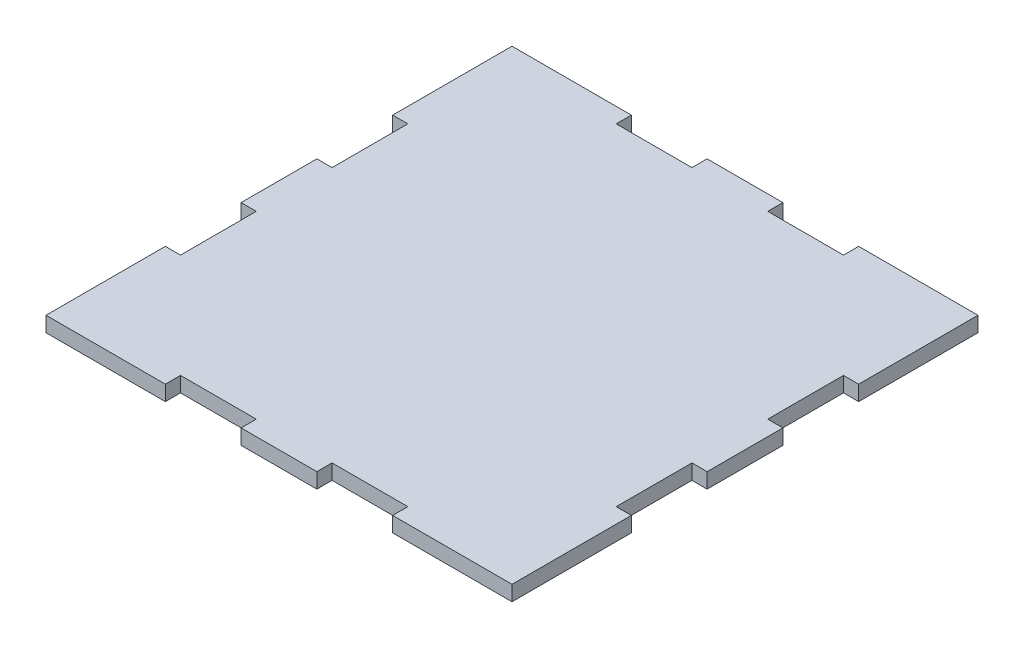
ISO-10303-21;
HEADER;
FILE_DESCRIPTION(('STEP AP214'),'2;1');
FILE_NAME('part.step','',(''),(''),'','','');
FILE_SCHEMA(('AUTOMOTIVE_DESIGN { 1 0 10303 214 1 1 1 1 }'));
ENDSEC;
DATA;
#1=APPLICATION_CONTEXT('core data for automotive mechanical design processes');
#2=APPLICATION_PROTOCOL_DEFINITION('international standard','automotive_design',2000,#1);
#3=PRODUCT_CONTEXT('',#1,'mechanical');
#4=PRODUCT('Part','Part','',(#3));
#5=PRODUCT_RELATED_PRODUCT_CATEGORY('part','',(#4));
#6=PRODUCT_DEFINITION_FORMATION('','',#4);
#7=PRODUCT_DEFINITION_CONTEXT('part definition',#1,'design');
#8=PRODUCT_DEFINITION('design','',#6,#7);
#9=PRODUCT_DEFINITION_SHAPE('','',#8);
#10=(LENGTH_UNIT() NAMED_UNIT(*) SI_UNIT(.MILLI.,.METRE.));
#11=(NAMED_UNIT(*) PLANE_ANGLE_UNIT() SI_UNIT($,.RADIAN.));
#12=(NAMED_UNIT(*) SI_UNIT($,.STERADIAN.) SOLID_ANGLE_UNIT());
#13=UNCERTAINTY_MEASURE_WITH_UNIT(LENGTH_MEASURE(1.E-05),#10,'distance_accuracy_value','');
#14=(GEOMETRIC_REPRESENTATION_CONTEXT(3) GLOBAL_UNCERTAINTY_ASSIGNED_CONTEXT((#13)) GLOBAL_UNIT_ASSIGNED_CONTEXT((#10,
#11,#12)) REPRESENTATION_CONTEXT('',''));
#15=CARTESIAN_POINT('',(0.,0.,0.));
#16=DIRECTION('',(0.,0.,1.));
#17=DIRECTION('',(1.,0.,0.));
#18=AXIS2_PLACEMENT_3D('',#15,#16,#17);
#19=CARTESIAN_POINT('',(0.,4.,0.));
#20=DIRECTION('',(1.,0.,0.));
#21=DIRECTION('',(0.,0.,-1.));
#22=AXIS2_PLACEMENT_3D('',#19,#20,#21);
#23=PLANE('',#22);
#24=DIRECTION('',(0.,0.,1.));
#25=VECTOR('',#24,1.);
#26=CARTESIAN_POINT('',(0.,0.,0.));
#27=LINE('',#26,#25);
#28=CARTESIAN_POINT('',(0.,0.,-31.5));
#29=VERTEX_POINT('',#28);
#30=CARTESIAN_POINT('',(0.,0.,0.));
#31=VERTEX_POINT('',#30);
#32=EDGE_CURVE('E308',#29,#31,#27,.T.);
#33=ORIENTED_EDGE('',*,*,#32,.T.);
#34=DIRECTION('',(0.,-1.,0.));
#35=VECTOR('',#34,1.);
#36=CARTESIAN_POINT('',(0.,4.,0.));
#37=LINE('',#36,#35);
#38=CARTESIAN_POINT('',(0.,4.,0.));
#39=VERTEX_POINT('',#38);
#40=EDGE_CURVE('E11',#39,#31,#37,.T.);
#41=ORIENTED_EDGE('',*,*,#40,.F.);
#42=DIRECTION('',(0.,0.,1.));
#43=VECTOR('',#42,1.);
#44=CARTESIAN_POINT('',(0.,4.,0.));
#45=LINE('',#44,#43);
#46=CARTESIAN_POINT('',(0.,4.,-31.5));
#47=VERTEX_POINT('',#46);
#48=EDGE_CURVE('E414',#47,#39,#45,.T.);
#49=ORIENTED_EDGE('',*,*,#48,.F.);
#50=DIRECTION('',(0.,-1.,0.));
#51=VECTOR('',#50,1.);
#52=CARTESIAN_POINT('',(0.,4.,-31.5));
#53=LINE('',#52,#51);
#54=EDGE_CURVE('E304',#47,#29,#53,.T.);
#55=ORIENTED_EDGE('',*,*,#54,.T.);
#56=EDGE_LOOP('',(#33,#41,#49,#55));
#57=FACE_BOUND('',#56,.T.);
#58=ADVANCED_FACE('F39',(#57),#23,.F.);
#59=CARTESIAN_POINT('',(0.,4.,0.));
#60=DIRECTION('',(0.,0.,-1.));
#61=DIRECTION('',(-1.,0.,0.));
#62=AXIS2_PLACEMENT_3D('',#59,#60,#61);
#63=PLANE('',#62);
#64=DIRECTION('',(1.,0.,0.));
#65=VECTOR('',#64,1.);
#66=CARTESIAN_POINT('',(0.,0.,0.));
#67=LINE('',#66,#65);
#68=CARTESIAN_POINT('',(31.5,0.,0.));
#69=VERTEX_POINT('',#68);
#70=EDGE_CURVE('E312',#31,#69,#67,.T.);
#71=ORIENTED_EDGE('',*,*,#70,.T.);
#72=DIRECTION('',(0.,-1.,0.));
#73=VECTOR('',#72,1.);
#74=CARTESIAN_POINT('',(31.5,4.,0.));
#75=LINE('',#74,#73);
#76=CARTESIAN_POINT('',(31.5,4.,0.));
#77=VERTEX_POINT('',#76);
#78=EDGE_CURVE('E48',#77,#69,#75,.T.);
#79=ORIENTED_EDGE('',*,*,#78,.F.);
#80=DIRECTION('',(1.,0.,0.));
#81=VECTOR('',#80,1.);
#82=CARTESIAN_POINT('',(0.,4.,0.));
#83=LINE('',#82,#81);
#84=EDGE_CURVE('E183',#39,#77,#83,.T.);
#85=ORIENTED_EDGE('',*,*,#84,.F.);
#86=ORIENTED_EDGE('',*,*,#40,.T.);
#87=EDGE_LOOP('',(#71,#79,#85,#86));
#88=FACE_BOUND('',#87,.T.);
#89=ADVANCED_FACE('F676',(#88),#63,.F.);
#90=CARTESIAN_POINT('',(31.5,4.,0.));
#91=DIRECTION('',(-1.,0.,0.));
#92=DIRECTION('',(0.,0.,1.));
#93=AXIS2_PLACEMENT_3D('',#90,#91,#92);
#94=PLANE('',#93);
#95=DIRECTION('',(0.,0.,-1.));
#96=VECTOR('',#95,1.);
#97=CARTESIAN_POINT('',(31.5,0.,0.));
#98=LINE('',#97,#96);
#99=CARTESIAN_POINT('',(31.5,0.,-4.));
#100=VERTEX_POINT('',#99);
#101=EDGE_CURVE('E315',#69,#100,#98,.T.);
#102=ORIENTED_EDGE('',*,*,#101,.T.);
#103=DIRECTION('',(0.,-1.,0.));
#104=VECTOR('',#103,1.);
#105=CARTESIAN_POINT('',(31.5,4.,-4.));
#106=LINE('',#105,#104);
#107=CARTESIAN_POINT('',(31.5,4.,-4.));
#108=VERTEX_POINT('',#107);
#109=EDGE_CURVE('E537',#108,#100,#106,.T.);
#110=ORIENTED_EDGE('',*,*,#109,.F.);
#111=DIRECTION('',(0.,0.,-1.));
#112=VECTOR('',#111,1.);
#113=CARTESIAN_POINT('',(31.5,4.,0.));
#114=LINE('',#113,#112);
#115=EDGE_CURVE('E547',#77,#108,#114,.T.);
#116=ORIENTED_EDGE('',*,*,#115,.F.);
#117=ORIENTED_EDGE('',*,*,#78,.T.);
#118=EDGE_LOOP('',(#102,#110,#116,#117));
#119=FACE_BOUND('',#118,.T.);
#120=ADVANCED_FACE('F545',(#119),#94,.F.);
#121=CARTESIAN_POINT('',(31.5,4.,-4.));
#122=DIRECTION('',(0.,0.,-1.));
#123=DIRECTION('',(-1.,0.,0.));
#124=AXIS2_PLACEMENT_3D('',#121,#122,#123);
#125=PLANE('',#124);
#126=DIRECTION('',(1.,0.,0.));
#127=VECTOR('',#126,1.);
#128=CARTESIAN_POINT('',(31.5,0.,-4.));
#129=LINE('',#128,#127);
#130=CARTESIAN_POINT('',(51.5,0.,-4.));
#131=VERTEX_POINT('',#130);
#132=EDGE_CURVE('E318',#100,#131,#129,.T.);
#133=ORIENTED_EDGE('',*,*,#132,.T.);
#134=DIRECTION('',(0.,-1.,0.));
#135=VECTOR('',#134,1.);
#136=CARTESIAN_POINT('',(51.5,4.,-4.));
#137=LINE('',#136,#135);
#138=CARTESIAN_POINT('',(51.5,4.,-4.));
#139=VERTEX_POINT('',#138);
#140=EDGE_CURVE('E533',#139,#131,#137,.T.);
#141=ORIENTED_EDGE('',*,*,#140,.F.);
#142=DIRECTION('',(1.,0.,0.));
#143=VECTOR('',#142,1.);
#144=CARTESIAN_POINT('',(31.5,4.,-4.));
#145=LINE('',#144,#143);
#146=EDGE_CURVE('E566',#108,#139,#145,.T.);
#147=ORIENTED_EDGE('',*,*,#146,.F.);
#148=ORIENTED_EDGE('',*,*,#109,.T.);
#149=EDGE_LOOP('',(#133,#141,#147,#148));
#150=FACE_BOUND('',#149,.T.);
#151=ADVANCED_FACE('F556',(#150),#125,.F.);
#152=CARTESIAN_POINT('',(51.5,4.,-4.));
#153=DIRECTION('',(1.,0.,0.));
#154=DIRECTION('',(0.,0.,-1.));
#155=AXIS2_PLACEMENT_3D('',#152,#153,#154);
#156=PLANE('',#155);
#157=DIRECTION('',(0.,0.,1.));
#158=VECTOR('',#157,1.);
#159=CARTESIAN_POINT('',(51.5,0.,-4.));
#160=LINE('',#159,#158);
#161=CARTESIAN_POINT('',(51.5,0.,0.));
#162=VERTEX_POINT('',#161);
#163=EDGE_CURVE('E321',#131,#162,#160,.T.);
#164=ORIENTED_EDGE('',*,*,#163,.T.);
#165=DIRECTION('',(0.,-1.,0.));
#166=VECTOR('',#165,1.);
#167=CARTESIAN_POINT('',(51.5,4.,0.));
#168=LINE('',#167,#166);
#169=CARTESIAN_POINT('',(51.5,4.,0.));
#170=VERTEX_POINT('',#169);
#171=EDGE_CURVE('E529',#170,#162,#168,.T.);
#172=ORIENTED_EDGE('',*,*,#171,.F.);
#173=DIRECTION('',(0.,0.,1.));
#174=VECTOR('',#173,1.);
#175=CARTESIAN_POINT('',(51.5,4.,-4.));
#176=LINE('',#175,#174);
#177=EDGE_CURVE('E562',#139,#170,#176,.T.);
#178=ORIENTED_EDGE('',*,*,#177,.F.);
#179=ORIENTED_EDGE('',*,*,#140,.T.);
#180=EDGE_LOOP('',(#164,#172,#178,#179));
#181=FACE_BOUND('',#180,.T.);
#182=ADVANCED_FACE('F560',(#181),#156,.F.);
#183=CARTESIAN_POINT('',(51.5,4.,0.));
#184=DIRECTION('',(0.,0.,-1.));
#185=DIRECTION('',(-1.,0.,0.));
#186=AXIS2_PLACEMENT_3D('',#183,#184,#185);
#187=PLANE('',#186);
#188=DIRECTION('',(1.,0.,0.));
#189=VECTOR('',#188,1.);
#190=CARTESIAN_POINT('',(51.5,0.,0.));
#191=LINE('',#190,#189);
#192=CARTESIAN_POINT('',(71.5,0.,0.));
#193=VERTEX_POINT('',#192);
#194=EDGE_CURVE('E324',#162,#193,#191,.T.);
#195=ORIENTED_EDGE('',*,*,#194,.T.);
#196=DIRECTION('',(0.,-1.,0.));
#197=VECTOR('',#196,1.);
#198=CARTESIAN_POINT('',(71.5,4.,0.));
#199=LINE('',#198,#197);
#200=CARTESIAN_POINT('',(71.5,4.,0.));
#201=VERTEX_POINT('',#200);
#202=EDGE_CURVE('E525',#201,#193,#199,.T.);
#203=ORIENTED_EDGE('',*,*,#202,.F.);
#204=DIRECTION('',(1.,0.,0.));
#205=VECTOR('',#204,1.);
#206=CARTESIAN_POINT('',(51.5,4.,0.));
#207=LINE('',#206,#205);
#208=EDGE_CURVE('E565',#170,#201,#207,.T.);
#209=ORIENTED_EDGE('',*,*,#208,.F.);
#210=ORIENTED_EDGE('',*,*,#171,.T.);
#211=EDGE_LOOP('',(#195,#203,#209,#210));
#212=FACE_BOUND('',#211,.T.);
#213=ADVANCED_FACE('F689',(#212),#187,.F.);
#214=CARTESIAN_POINT('',(71.5,4.,0.));
#215=DIRECTION('',(-1.,0.,0.));
#216=DIRECTION('',(0.,0.,1.));
#217=AXIS2_PLACEMENT_3D('',#214,#215,#216);
#218=PLANE('',#217);
#219=DIRECTION('',(0.,0.,-1.));
#220=VECTOR('',#219,1.);
#221=CARTESIAN_POINT('',(71.5,0.,0.));
#222=LINE('',#221,#220);
#223=CARTESIAN_POINT('',(71.5,0.,-4.));
#224=VERTEX_POINT('',#223);
#225=EDGE_CURVE('E327',#193,#224,#222,.T.);
#226=ORIENTED_EDGE('',*,*,#225,.T.);
#227=DIRECTION('',(0.,-1.,0.));
#228=VECTOR('',#227,1.);
#229=CARTESIAN_POINT('',(71.5,4.,-4.));
#230=LINE('',#229,#228);
#231=CARTESIAN_POINT('',(71.5,4.,-4.));
#232=VERTEX_POINT('',#231);
#233=EDGE_CURVE('E521',#232,#224,#230,.T.);
#234=ORIENTED_EDGE('',*,*,#233,.F.);
#235=DIRECTION('',(0.,0.,-1.));
#236=VECTOR('',#235,1.);
#237=CARTESIAN_POINT('',(71.5,4.,0.));
#238=LINE('',#237,#236);
#239=EDGE_CURVE('E570',#201,#232,#238,.T.);
#240=ORIENTED_EDGE('',*,*,#239,.F.);
#241=ORIENTED_EDGE('',*,*,#202,.T.);
#242=EDGE_LOOP('',(#226,#234,#240,#241));
#243=FACE_BOUND('',#242,.T.);
#244=ADVANCED_FACE('F692',(#243),#218,.F.);
#245=CARTESIAN_POINT('',(71.5,4.,-4.));
#246=DIRECTION('',(0.,0.,-1.));
#247=DIRECTION('',(-1.,0.,0.));
#248=AXIS2_PLACEMENT_3D('',#245,#246,#247);
#249=PLANE('',#248);
#250=DIRECTION('',(1.,0.,0.));
#251=VECTOR('',#250,1.);
#252=CARTESIAN_POINT('',(71.5,0.,-4.));
#253=LINE('',#252,#251);
#254=CARTESIAN_POINT('',(91.5,0.,-4.));
#255=VERTEX_POINT('',#254);
#256=EDGE_CURVE('E330',#224,#255,#253,.T.);
#257=ORIENTED_EDGE('',*,*,#256,.T.);
#258=DIRECTION('',(0.,-1.,0.));
#259=VECTOR('',#258,1.);
#260=CARTESIAN_POINT('',(91.5,4.,-4.));
#261=LINE('',#260,#259);
#262=CARTESIAN_POINT('',(91.5,4.,-4.));
#263=VERTEX_POINT('',#262);
#264=EDGE_CURVE('E517',#263,#255,#261,.T.);
#265=ORIENTED_EDGE('',*,*,#264,.F.);
#266=DIRECTION('',(1.,0.,0.));
#267=VECTOR('',#266,1.);
#268=CARTESIAN_POINT('',(71.5,4.,-4.));
#269=LINE('',#268,#267);
#270=EDGE_CURVE('E577',#232,#263,#269,.T.);
#271=ORIENTED_EDGE('',*,*,#270,.F.);
#272=ORIENTED_EDGE('',*,*,#233,.T.);
#273=EDGE_LOOP('',(#257,#265,#271,#272));
#274=FACE_BOUND('',#273,.T.);
#275=ADVANCED_FACE('F696',(#274),#249,.F.);
#276=CARTESIAN_POINT('',(91.5,4.,-4.));
#277=DIRECTION('',(1.,0.,0.));
#278=DIRECTION('',(0.,0.,-1.));
#279=AXIS2_PLACEMENT_3D('',#276,#277,#278);
#280=PLANE('',#279);
#281=DIRECTION('',(0.,0.,1.));
#282=VECTOR('',#281,1.);
#283=CARTESIAN_POINT('',(91.5,0.,-4.));
#284=LINE('',#283,#282);
#285=CARTESIAN_POINT('',(91.5,0.,0.));
#286=VERTEX_POINT('',#285);
#287=EDGE_CURVE('E333',#255,#286,#284,.T.);
#288=ORIENTED_EDGE('',*,*,#287,.T.);
#289=DIRECTION('',(0.,-1.,0.));
#290=VECTOR('',#289,1.);
#291=CARTESIAN_POINT('',(91.5,4.,0.));
#292=LINE('',#291,#290);
#293=CARTESIAN_POINT('',(91.5,4.,0.));
#294=VERTEX_POINT('',#293);
#295=EDGE_CURVE('E513',#294,#286,#292,.T.);
#296=ORIENTED_EDGE('',*,*,#295,.F.);
#297=DIRECTION('',(0.,0.,1.));
#298=VECTOR('',#297,1.);
#299=CARTESIAN_POINT('',(91.5,4.,-4.));
#300=LINE('',#299,#298);
#301=EDGE_CURVE('E580',#263,#294,#300,.T.);
#302=ORIENTED_EDGE('',*,*,#301,.F.);
#303=ORIENTED_EDGE('',*,*,#264,.T.);
#304=EDGE_LOOP('',(#288,#296,#302,#303));
#305=FACE_BOUND('',#304,.T.);
#306=ADVANCED_FACE('F700',(#305),#280,.F.);
#307=CARTESIAN_POINT('',(91.5,4.,0.));
#308=DIRECTION('',(0.,0.,-1.));
#309=DIRECTION('',(-1.,0.,0.));
#310=AXIS2_PLACEMENT_3D('',#307,#308,#309);
#311=PLANE('',#310);
#312=DIRECTION('',(1.,0.,0.));
#313=VECTOR('',#312,1.);
#314=CARTESIAN_POINT('',(91.5,0.,0.));
#315=LINE('',#314,#313);
#316=CARTESIAN_POINT('',(123.,0.,0.));
#317=VERTEX_POINT('',#316);
#318=EDGE_CURVE('E336',#286,#317,#315,.T.);
#319=ORIENTED_EDGE('',*,*,#318,.T.);
#320=DIRECTION('',(0.,-1.,0.));
#321=VECTOR('',#320,1.);
#322=CARTESIAN_POINT('',(123.,4.,0.));
#323=LINE('',#322,#321);
#324=CARTESIAN_POINT('',(123.,4.,0.));
#325=VERTEX_POINT('',#324);
#326=EDGE_CURVE('E509',#325,#317,#323,.T.);
#327=ORIENTED_EDGE('',*,*,#326,.F.);
#328=DIRECTION('',(1.,0.,0.));
#329=VECTOR('',#328,1.);
#330=CARTESIAN_POINT('',(91.5,4.,0.));
#331=LINE('',#330,#329);
#332=EDGE_CURVE('E583',#294,#325,#331,.T.);
#333=ORIENTED_EDGE('',*,*,#332,.F.);
#334=ORIENTED_EDGE('',*,*,#295,.T.);
#335=EDGE_LOOP('',(#319,#327,#333,#334));
#336=FACE_BOUND('',#335,.T.);
#337=ADVANCED_FACE('F704',(#336),#311,.F.);
#338=CARTESIAN_POINT('',(123.,4.,0.));
#339=DIRECTION('',(-1.,0.,0.));
#340=DIRECTION('',(0.,0.,1.));
#341=AXIS2_PLACEMENT_3D('',#338,#339,#340);
#342=PLANE('',#341);
#343=DIRECTION('',(0.,0.,-1.));
#344=VECTOR('',#343,1.);
#345=CARTESIAN_POINT('',(123.,0.,0.));
#346=LINE('',#345,#344);
#347=CARTESIAN_POINT('',(123.,0.,-31.5));
#348=VERTEX_POINT('',#347);
#349=EDGE_CURVE('E339',#317,#348,#346,.T.);
#350=ORIENTED_EDGE('',*,*,#349,.T.);
#351=DIRECTION('',(0.,-1.,0.));
#352=VECTOR('',#351,1.);
#353=CARTESIAN_POINT('',(123.,4.,-31.5));
#354=LINE('',#353,#352);
#355=CARTESIAN_POINT('',(123.,4.,-31.5));
#356=VERTEX_POINT('',#355);
#357=EDGE_CURVE('E505',#356,#348,#354,.T.);
#358=ORIENTED_EDGE('',*,*,#357,.F.);
#359=DIRECTION('',(0.,0.,-1.));
#360=VECTOR('',#359,1.);
#361=CARTESIAN_POINT('',(123.,4.,0.));
#362=LINE('',#361,#360);
#363=EDGE_CURVE('E586',#325,#356,#362,.T.);
#364=ORIENTED_EDGE('',*,*,#363,.F.);
#365=ORIENTED_EDGE('',*,*,#326,.T.);
#366=EDGE_LOOP('',(#350,#358,#364,#365));
#367=FACE_BOUND('',#366,.T.);
#368=ADVANCED_FACE('F708',(#367),#342,.F.);
#369=CARTESIAN_POINT('',(123.,4.,-31.5));
#370=DIRECTION('',(0.,0.,1.));
#371=DIRECTION('',(1.,0.,0.));
#372=AXIS2_PLACEMENT_3D('',#369,#370,#371);
#373=PLANE('',#372);
#374=DIRECTION('',(-1.,0.,0.));
#375=VECTOR('',#374,1.);
#376=CARTESIAN_POINT('',(123.,0.,-31.5));
#377=LINE('',#376,#375);
#378=CARTESIAN_POINT('',(119.,0.,-31.5));
#379=VERTEX_POINT('',#378);
#380=EDGE_CURVE('E342',#348,#379,#377,.T.);
#381=ORIENTED_EDGE('',*,*,#380,.T.);
#382=DIRECTION('',(0.,-1.,0.));
#383=VECTOR('',#382,1.);
#384=CARTESIAN_POINT('',(119.,4.,-31.5));
#385=LINE('',#384,#383);
#386=CARTESIAN_POINT('',(119.,4.,-31.5));
#387=VERTEX_POINT('',#386);
#388=EDGE_CURVE('E501',#387,#379,#385,.T.);
#389=ORIENTED_EDGE('',*,*,#388,.F.);
#390=DIRECTION('',(-1.,0.,0.));
#391=VECTOR('',#390,1.);
#392=CARTESIAN_POINT('',(123.,4.,-31.5));
#393=LINE('',#392,#391);
#394=EDGE_CURVE('E589',#356,#387,#393,.T.);
#395=ORIENTED_EDGE('',*,*,#394,.F.);
#396=ORIENTED_EDGE('',*,*,#357,.T.);
#397=EDGE_LOOP('',(#381,#389,#395,#396));
#398=FACE_BOUND('',#397,.T.);
#399=ADVANCED_FACE('F712',(#398),#373,.F.);
#400=CARTESIAN_POINT('',(119.,4.,-31.5));
#401=DIRECTION('',(-1.,0.,0.));
#402=DIRECTION('',(0.,0.,1.));
#403=AXIS2_PLACEMENT_3D('',#400,#401,#402);
#404=PLANE('',#403);
#405=DIRECTION('',(0.,0.,-1.));
#406=VECTOR('',#405,1.);
#407=CARTESIAN_POINT('',(119.,0.,-31.5));
#408=LINE('',#407,#406);
#409=CARTESIAN_POINT('',(119.,0.,-51.5));
#410=VERTEX_POINT('',#409);
#411=EDGE_CURVE('E345',#379,#410,#408,.T.);
#412=ORIENTED_EDGE('',*,*,#411,.T.);
#413=DIRECTION('',(0.,-1.,0.));
#414=VECTOR('',#413,1.);
#415=CARTESIAN_POINT('',(119.,4.,-51.5));
#416=LINE('',#415,#414);
#417=CARTESIAN_POINT('',(119.,4.,-51.5));
#418=VERTEX_POINT('',#417);
#419=EDGE_CURVE('E497',#418,#410,#416,.T.);
#420=ORIENTED_EDGE('',*,*,#419,.F.);
#421=DIRECTION('',(0.,0.,-1.));
#422=VECTOR('',#421,1.);
#423=CARTESIAN_POINT('',(119.,4.,-31.5));
#424=LINE('',#423,#422);
#425=EDGE_CURVE('E592',#387,#418,#424,.T.);
#426=ORIENTED_EDGE('',*,*,#425,.F.);
#427=ORIENTED_EDGE('',*,*,#388,.T.);
#428=EDGE_LOOP('',(#412,#420,#426,#427));
#429=FACE_BOUND('',#428,.T.);
#430=ADVANCED_FACE('F716',(#429),#404,.F.);
#431=CARTESIAN_POINT('',(119.,4.,-51.5));
#432=DIRECTION('',(0.,0.,-1.));
#433=DIRECTION('',(-1.,0.,0.));
#434=AXIS2_PLACEMENT_3D('',#431,#432,#433);
#435=PLANE('',#434);
#436=DIRECTION('',(1.,0.,0.));
#437=VECTOR('',#436,1.);
#438=CARTESIAN_POINT('',(119.,0.,-51.5));
#439=LINE('',#438,#437);
#440=CARTESIAN_POINT('',(123.,0.,-51.5));
#441=VERTEX_POINT('',#440);
#442=EDGE_CURVE('E348',#410,#441,#439,.T.);
#443=ORIENTED_EDGE('',*,*,#442,.T.);
#444=DIRECTION('',(0.,-1.,0.));
#445=VECTOR('',#444,1.);
#446=CARTESIAN_POINT('',(123.,4.,-51.5));
#447=LINE('',#446,#445);
#448=CARTESIAN_POINT('',(123.,4.,-51.5));
#449=VERTEX_POINT('',#448);
#450=EDGE_CURVE('E493',#449,#441,#447,.T.);
#451=ORIENTED_EDGE('',*,*,#450,.F.);
#452=DIRECTION('',(1.,0.,0.));
#453=VECTOR('',#452,1.);
#454=CARTESIAN_POINT('',(119.,4.,-51.5));
#455=LINE('',#454,#453);
#456=EDGE_CURVE('E595',#418,#449,#455,.T.);
#457=ORIENTED_EDGE('',*,*,#456,.F.);
#458=ORIENTED_EDGE('',*,*,#419,.T.);
#459=EDGE_LOOP('',(#443,#451,#457,#458));
#460=FACE_BOUND('',#459,.T.);
#461=ADVANCED_FACE('F720',(#460),#435,.F.);
#462=CARTESIAN_POINT('',(123.,4.,-51.5));
#463=DIRECTION('',(-1.,0.,0.));
#464=DIRECTION('',(0.,0.,1.));
#465=AXIS2_PLACEMENT_3D('',#462,#463,#464);
#466=PLANE('',#465);
#467=DIRECTION('',(0.,0.,-1.));
#468=VECTOR('',#467,1.);
#469=CARTESIAN_POINT('',(123.,0.,-51.5));
#470=LINE('',#469,#468);
#471=CARTESIAN_POINT('',(123.,0.,-71.5));
#472=VERTEX_POINT('',#471);
#473=EDGE_CURVE('E351',#441,#472,#470,.T.);
#474=ORIENTED_EDGE('',*,*,#473,.T.);
#475=DIRECTION('',(0.,-1.,0.));
#476=VECTOR('',#475,1.);
#477=CARTESIAN_POINT('',(123.,4.,-71.5));
#478=LINE('',#477,#476);
#479=CARTESIAN_POINT('',(123.,4.,-71.5));
#480=VERTEX_POINT('',#479);
#481=EDGE_CURVE('E489',#480,#472,#478,.T.);
#482=ORIENTED_EDGE('',*,*,#481,.F.);
#483=DIRECTION('',(0.,0.,-1.));
#484=VECTOR('',#483,1.);
#485=CARTESIAN_POINT('',(123.,4.,-51.5));
#486=LINE('',#485,#484);
#487=EDGE_CURVE('E598',#449,#480,#486,.T.);
#488=ORIENTED_EDGE('',*,*,#487,.F.);
#489=ORIENTED_EDGE('',*,*,#450,.T.);
#490=EDGE_LOOP('',(#474,#482,#488,#489));
#491=FACE_BOUND('',#490,.T.);
#492=ADVANCED_FACE('F724',(#491),#466,.F.);
#493=CARTESIAN_POINT('',(123.,4.,-71.5));
#494=DIRECTION('',(0.,0.,1.));
#495=DIRECTION('',(1.,0.,0.));
#496=AXIS2_PLACEMENT_3D('',#493,#494,#495);
#497=PLANE('',#496);
#498=DIRECTION('',(-1.,0.,0.));
#499=VECTOR('',#498,1.);
#500=CARTESIAN_POINT('',(123.,0.,-71.5));
#501=LINE('',#500,#499);
#502=CARTESIAN_POINT('',(119.,0.,-71.5));
#503=VERTEX_POINT('',#502);
#504=EDGE_CURVE('E354',#472,#503,#501,.T.);
#505=ORIENTED_EDGE('',*,*,#504,.T.);
#506=DIRECTION('',(0.,-1.,0.));
#507=VECTOR('',#506,1.);
#508=CARTESIAN_POINT('',(119.,4.,-71.5));
#509=LINE('',#508,#507);
#510=CARTESIAN_POINT('',(119.,4.,-71.5));
#511=VERTEX_POINT('',#510);
#512=EDGE_CURVE('E485',#511,#503,#509,.T.);
#513=ORIENTED_EDGE('',*,*,#512,.F.);
#514=DIRECTION('',(-1.,0.,0.));
#515=VECTOR('',#514,1.);
#516=CARTESIAN_POINT('',(123.,4.,-71.5));
#517=LINE('',#516,#515);
#518=EDGE_CURVE('E601',#480,#511,#517,.T.);
#519=ORIENTED_EDGE('',*,*,#518,.F.);
#520=ORIENTED_EDGE('',*,*,#481,.T.);
#521=EDGE_LOOP('',(#505,#513,#519,#520));
#522=FACE_BOUND('',#521,.T.);
#523=ADVANCED_FACE('F728',(#522),#497,.F.);
#524=CARTESIAN_POINT('',(119.,4.,-71.5));
#525=DIRECTION('',(-1.,0.,0.));
#526=DIRECTION('',(0.,0.,1.));
#527=AXIS2_PLACEMENT_3D('',#524,#525,#526);
#528=PLANE('',#527);
#529=DIRECTION('',(0.,0.,-1.));
#530=VECTOR('',#529,1.);
#531=CARTESIAN_POINT('',(119.,0.,-71.5));
#532=LINE('',#531,#530);
#533=CARTESIAN_POINT('',(119.,0.,-91.5));
#534=VERTEX_POINT('',#533);
#535=EDGE_CURVE('E357',#503,#534,#532,.T.);
#536=ORIENTED_EDGE('',*,*,#535,.T.);
#537=DIRECTION('',(0.,-1.,0.));
#538=VECTOR('',#537,1.);
#539=CARTESIAN_POINT('',(119.,4.,-91.5));
#540=LINE('',#539,#538);
#541=CARTESIAN_POINT('',(119.,4.,-91.5));
#542=VERTEX_POINT('',#541);
#543=EDGE_CURVE('E481',#542,#534,#540,.T.);
#544=ORIENTED_EDGE('',*,*,#543,.F.);
#545=DIRECTION('',(0.,0.,-1.));
#546=VECTOR('',#545,1.);
#547=CARTESIAN_POINT('',(119.,4.,-71.5));
#548=LINE('',#547,#546);
#549=EDGE_CURVE('E604',#511,#542,#548,.T.);
#550=ORIENTED_EDGE('',*,*,#549,.F.);
#551=ORIENTED_EDGE('',*,*,#512,.T.);
#552=EDGE_LOOP('',(#536,#544,#550,#551));
#553=FACE_BOUND('',#552,.T.);
#554=ADVANCED_FACE('F732',(#553),#528,.F.);
#555=CARTESIAN_POINT('',(119.,4.,-91.5));
#556=DIRECTION('',(0.,0.,-1.));
#557=DIRECTION('',(-1.,0.,0.));
#558=AXIS2_PLACEMENT_3D('',#555,#556,#557);
#559=PLANE('',#558);
#560=DIRECTION('',(1.,0.,0.));
#561=VECTOR('',#560,1.);
#562=CARTESIAN_POINT('',(119.,0.,-91.5));
#563=LINE('',#562,#561);
#564=CARTESIAN_POINT('',(123.,0.,-91.5));
#565=VERTEX_POINT('',#564);
#566=EDGE_CURVE('E360',#534,#565,#563,.T.);
#567=ORIENTED_EDGE('',*,*,#566,.T.);
#568=DIRECTION('',(0.,-1.,0.));
#569=VECTOR('',#568,1.);
#570=CARTESIAN_POINT('',(123.,4.,-91.5));
#571=LINE('',#570,#569);
#572=CARTESIAN_POINT('',(123.,4.,-91.5));
#573=VERTEX_POINT('',#572);
#574=EDGE_CURVE('E477',#573,#565,#571,.T.);
#575=ORIENTED_EDGE('',*,*,#574,.F.);
#576=DIRECTION('',(1.,0.,0.));
#577=VECTOR('',#576,1.);
#578=CARTESIAN_POINT('',(119.,4.,-91.5));
#579=LINE('',#578,#577);
#580=EDGE_CURVE('E607',#542,#573,#579,.T.);
#581=ORIENTED_EDGE('',*,*,#580,.F.);
#582=ORIENTED_EDGE('',*,*,#543,.T.);
#583=EDGE_LOOP('',(#567,#575,#581,#582));
#584=FACE_BOUND('',#583,.T.);
#585=ADVANCED_FACE('F736',(#584),#559,.F.);
#586=CARTESIAN_POINT('',(123.,4.,-91.5));
#587=DIRECTION('',(-1.,0.,0.));
#588=DIRECTION('',(0.,0.,1.));
#589=AXIS2_PLACEMENT_3D('',#586,#587,#588);
#590=PLANE('',#589);
#591=DIRECTION('',(0.,0.,-1.));
#592=VECTOR('',#591,1.);
#593=CARTESIAN_POINT('',(123.,0.,-91.5));
#594=LINE('',#593,#592);
#595=CARTESIAN_POINT('',(123.,0.,-123.));
#596=VERTEX_POINT('',#595);
#597=EDGE_CURVE('E363',#565,#596,#594,.T.);
#598=ORIENTED_EDGE('',*,*,#597,.T.);
#599=DIRECTION('',(0.,-1.,0.));
#600=VECTOR('',#599,1.);
#601=CARTESIAN_POINT('',(123.,4.,-123.));
#602=LINE('',#601,#600);
#603=CARTESIAN_POINT('',(123.,4.,-123.));
#604=VERTEX_POINT('',#603);
#605=EDGE_CURVE('E473',#604,#596,#602,.T.);
#606=ORIENTED_EDGE('',*,*,#605,.F.);
#607=DIRECTION('',(0.,0.,-1.));
#608=VECTOR('',#607,1.);
#609=CARTESIAN_POINT('',(123.,4.,-91.5));
#610=LINE('',#609,#608);
#611=EDGE_CURVE('E610',#573,#604,#610,.T.);
#612=ORIENTED_EDGE('',*,*,#611,.F.);
#613=ORIENTED_EDGE('',*,*,#574,.T.);
#614=EDGE_LOOP('',(#598,#606,#612,#613));
#615=FACE_BOUND('',#614,.T.);
#616=ADVANCED_FACE('F740',(#615),#590,.F.);
#617=CARTESIAN_POINT('',(91.5,4.,-123.));
#618=DIRECTION('',(0.,0.,1.));
#619=DIRECTION('',(1.,0.,0.));
#620=AXIS2_PLACEMENT_3D('',#617,#618,#619);
#621=PLANE('',#620);
#622=DIRECTION('',(-1.,0.,0.));
#623=VECTOR('',#622,1.);
#624=CARTESIAN_POINT('',(91.5,0.,-123.));
#625=LINE('',#624,#623);
#626=CARTESIAN_POINT('',(91.5,0.,-123.));
#627=VERTEX_POINT('',#626);
#628=EDGE_CURVE('E366',#596,#627,#625,.T.);
#629=ORIENTED_EDGE('',*,*,#628,.T.);
#630=DIRECTION('',(0.,-1.,0.));
#631=VECTOR('',#630,1.);
#632=CARTESIAN_POINT('',(91.5,4.,-123.));
#633=LINE('',#632,#631);
#634=CARTESIAN_POINT('',(91.5,4.,-123.));
#635=VERTEX_POINT('',#634);
#636=EDGE_CURVE('E469',#635,#627,#633,.T.);
#637=ORIENTED_EDGE('',*,*,#636,.F.);
#638=DIRECTION('',(-1.,0.,0.));
#639=VECTOR('',#638,1.);
#640=CARTESIAN_POINT('',(91.5,4.,-123.));
#641=LINE('',#640,#639);
#642=EDGE_CURVE('E613',#604,#635,#641,.T.);
#643=ORIENTED_EDGE('',*,*,#642,.F.);
#644=ORIENTED_EDGE('',*,*,#605,.T.);
#645=EDGE_LOOP('',(#629,#637,#643,#644));
#646=FACE_BOUND('',#645,.T.);
#647=ADVANCED_FACE('F744',(#646),#621,.F.);
#648=CARTESIAN_POINT('',(91.5,4.,-123.));
#649=DIRECTION('',(1.,0.,0.));
#650=DIRECTION('',(0.,0.,-1.));
#651=AXIS2_PLACEMENT_3D('',#648,#649,#650);
#652=PLANE('',#651);
#653=DIRECTION('',(0.,0.,1.));
#654=VECTOR('',#653,1.);
#655=CARTESIAN_POINT('',(91.5,0.,-123.));
#656=LINE('',#655,#654);
#657=CARTESIAN_POINT('',(91.5,0.,-119.));
#658=VERTEX_POINT('',#657);
#659=EDGE_CURVE('E369',#627,#658,#656,.T.);
#660=ORIENTED_EDGE('',*,*,#659,.T.);
#661=DIRECTION('',(0.,-1.,0.));
#662=VECTOR('',#661,1.);
#663=CARTESIAN_POINT('',(91.5,4.,-119.));
#664=LINE('',#663,#662);
#665=CARTESIAN_POINT('',(91.5,4.,-119.));
#666=VERTEX_POINT('',#665);
#667=EDGE_CURVE('E465',#666,#658,#664,.T.);
#668=ORIENTED_EDGE('',*,*,#667,.F.);
#669=DIRECTION('',(0.,0.,1.));
#670=VECTOR('',#669,1.);
#671=CARTESIAN_POINT('',(91.5,4.,-123.));
#672=LINE('',#671,#670);
#673=EDGE_CURVE('E616',#635,#666,#672,.T.);
#674=ORIENTED_EDGE('',*,*,#673,.F.);
#675=ORIENTED_EDGE('',*,*,#636,.T.);
#676=EDGE_LOOP('',(#660,#668,#674,#675));
#677=FACE_BOUND('',#676,.T.);
#678=ADVANCED_FACE('F748',(#677),#652,.F.);
#679=CARTESIAN_POINT('',(91.5,4.,-119.));
#680=DIRECTION('',(0.,0.,1.));
#681=DIRECTION('',(1.,0.,0.));
#682=AXIS2_PLACEMENT_3D('',#679,#680,#681);
#683=PLANE('',#682);
#684=DIRECTION('',(-1.,0.,0.));
#685=VECTOR('',#684,1.);
#686=CARTESIAN_POINT('',(91.5,0.,-119.));
#687=LINE('',#686,#685);
#688=CARTESIAN_POINT('',(71.5,0.,-119.));
#689=VERTEX_POINT('',#688);
#690=EDGE_CURVE('E372',#658,#689,#687,.T.);
#691=ORIENTED_EDGE('',*,*,#690,.T.);
#692=DIRECTION('',(0.,-1.,0.));
#693=VECTOR('',#692,1.);
#694=CARTESIAN_POINT('',(71.5,4.,-119.));
#695=LINE('',#694,#693);
#696=CARTESIAN_POINT('',(71.5,4.,-119.));
#697=VERTEX_POINT('',#696);
#698=EDGE_CURVE('E461',#697,#689,#695,.T.);
#699=ORIENTED_EDGE('',*,*,#698,.F.);
#700=DIRECTION('',(-1.,0.,0.));
#701=VECTOR('',#700,1.);
#702=CARTESIAN_POINT('',(91.5,4.,-119.));
#703=LINE('',#702,#701);
#704=EDGE_CURVE('E619',#666,#697,#703,.T.);
#705=ORIENTED_EDGE('',*,*,#704,.F.);
#706=ORIENTED_EDGE('',*,*,#667,.T.);
#707=EDGE_LOOP('',(#691,#699,#705,#706));
#708=FACE_BOUND('',#707,.T.);
#709=ADVANCED_FACE('F752',(#708),#683,.F.);
#710=CARTESIAN_POINT('',(71.5,4.,-119.));
#711=DIRECTION('',(-1.,0.,0.));
#712=DIRECTION('',(0.,0.,1.));
#713=AXIS2_PLACEMENT_3D('',#710,#711,#712);
#714=PLANE('',#713);
#715=DIRECTION('',(0.,0.,-1.));
#716=VECTOR('',#715,1.);
#717=CARTESIAN_POINT('',(71.5,0.,-119.));
#718=LINE('',#717,#716);
#719=CARTESIAN_POINT('',(71.5,0.,-123.));
#720=VERTEX_POINT('',#719);
#721=EDGE_CURVE('E375',#689,#720,#718,.T.);
#722=ORIENTED_EDGE('',*,*,#721,.T.);
#723=DIRECTION('',(0.,-1.,0.));
#724=VECTOR('',#723,1.);
#725=CARTESIAN_POINT('',(71.5,4.,-123.));
#726=LINE('',#725,#724);
#727=CARTESIAN_POINT('',(71.5,4.,-123.));
#728=VERTEX_POINT('',#727);
#729=EDGE_CURVE('E457',#728,#720,#726,.T.);
#730=ORIENTED_EDGE('',*,*,#729,.F.);
#731=DIRECTION('',(0.,0.,-1.));
#732=VECTOR('',#731,1.);
#733=CARTESIAN_POINT('',(71.5,4.,-119.));
#734=LINE('',#733,#732);
#735=EDGE_CURVE('E622',#697,#728,#734,.T.);
#736=ORIENTED_EDGE('',*,*,#735,.F.);
#737=ORIENTED_EDGE('',*,*,#698,.T.);
#738=EDGE_LOOP('',(#722,#730,#736,#737));
#739=FACE_BOUND('',#738,.T.);
#740=ADVANCED_FACE('F756',(#739),#714,.F.);
#741=CARTESIAN_POINT('',(51.5,4.,-123.));
#742=DIRECTION('',(0.,0.,1.));
#743=DIRECTION('',(1.,0.,0.));
#744=AXIS2_PLACEMENT_3D('',#741,#742,#743);
#745=PLANE('',#744);
#746=DIRECTION('',(-1.,0.,0.));
#747=VECTOR('',#746,1.);
#748=CARTESIAN_POINT('',(51.5,0.,-123.));
#749=LINE('',#748,#747);
#750=CARTESIAN_POINT('',(51.5,0.,-123.));
#751=VERTEX_POINT('',#750);
#752=EDGE_CURVE('E378',#720,#751,#749,.T.);
#753=ORIENTED_EDGE('',*,*,#752,.T.);
#754=DIRECTION('',(0.,-1.,0.));
#755=VECTOR('',#754,1.);
#756=CARTESIAN_POINT('',(51.5,4.,-123.));
#757=LINE('',#756,#755);
#758=CARTESIAN_POINT('',(51.5,4.,-123.));
#759=VERTEX_POINT('',#758);
#760=EDGE_CURVE('E453',#759,#751,#757,.T.);
#761=ORIENTED_EDGE('',*,*,#760,.F.);
#762=DIRECTION('',(-1.,0.,0.));
#763=VECTOR('',#762,1.);
#764=CARTESIAN_POINT('',(51.5,4.,-123.));
#765=LINE('',#764,#763);
#766=EDGE_CURVE('E625',#728,#759,#765,.T.);
#767=ORIENTED_EDGE('',*,*,#766,.F.);
#768=ORIENTED_EDGE('',*,*,#729,.T.);
#769=EDGE_LOOP('',(#753,#761,#767,#768));
#770=FACE_BOUND('',#769,.T.);
#771=ADVANCED_FACE('F760',(#770),#745,.F.);
#772=CARTESIAN_POINT('',(51.5,4.,-123.));
#773=DIRECTION('',(1.,0.,0.));
#774=DIRECTION('',(0.,0.,-1.));
#775=AXIS2_PLACEMENT_3D('',#772,#773,#774);
#776=PLANE('',#775);
#777=DIRECTION('',(0.,0.,1.));
#778=VECTOR('',#777,1.);
#779=CARTESIAN_POINT('',(51.5,0.,-123.));
#780=LINE('',#779,#778);
#781=CARTESIAN_POINT('',(51.5,0.,-119.));
#782=VERTEX_POINT('',#781);
#783=EDGE_CURVE('E381',#751,#782,#780,.T.);
#784=ORIENTED_EDGE('',*,*,#783,.T.);
#785=DIRECTION('',(0.,-1.,0.));
#786=VECTOR('',#785,1.);
#787=CARTESIAN_POINT('',(51.5,4.,-119.));
#788=LINE('',#787,#786);
#789=CARTESIAN_POINT('',(51.5,4.,-119.));
#790=VERTEX_POINT('',#789);
#791=EDGE_CURVE('E449',#790,#782,#788,.T.);
#792=ORIENTED_EDGE('',*,*,#791,.F.);
#793=DIRECTION('',(0.,0.,1.));
#794=VECTOR('',#793,1.);
#795=CARTESIAN_POINT('',(51.5,4.,-123.));
#796=LINE('',#795,#794);
#797=EDGE_CURVE('E628',#759,#790,#796,.T.);
#798=ORIENTED_EDGE('',*,*,#797,.F.);
#799=ORIENTED_EDGE('',*,*,#760,.T.);
#800=EDGE_LOOP('',(#784,#792,#798,#799));
#801=FACE_BOUND('',#800,.T.);
#802=ADVANCED_FACE('F764',(#801),#776,.F.);
#803=CARTESIAN_POINT('',(51.5,4.,-119.));
#804=DIRECTION('',(0.,0.,1.));
#805=DIRECTION('',(1.,0.,0.));
#806=AXIS2_PLACEMENT_3D('',#803,#804,#805);
#807=PLANE('',#806);
#808=DIRECTION('',(-1.,0.,0.));
#809=VECTOR('',#808,1.);
#810=CARTESIAN_POINT('',(51.5,0.,-119.));
#811=LINE('',#810,#809);
#812=CARTESIAN_POINT('',(31.5,0.,-119.));
#813=VERTEX_POINT('',#812);
#814=EDGE_CURVE('E384',#782,#813,#811,.T.);
#815=ORIENTED_EDGE('',*,*,#814,.T.);
#816=DIRECTION('',(0.,-1.,0.));
#817=VECTOR('',#816,1.);
#818=CARTESIAN_POINT('',(31.5,4.,-119.));
#819=LINE('',#818,#817);
#820=CARTESIAN_POINT('',(31.5,4.,-119.));
#821=VERTEX_POINT('',#820);
#822=EDGE_CURVE('E445',#821,#813,#819,.T.);
#823=ORIENTED_EDGE('',*,*,#822,.F.);
#824=DIRECTION('',(-1.,0.,0.));
#825=VECTOR('',#824,1.);
#826=CARTESIAN_POINT('',(51.5,4.,-119.));
#827=LINE('',#826,#825);
#828=EDGE_CURVE('E631',#790,#821,#827,.T.);
#829=ORIENTED_EDGE('',*,*,#828,.F.);
#830=ORIENTED_EDGE('',*,*,#791,.T.);
#831=EDGE_LOOP('',(#815,#823,#829,#830));
#832=FACE_BOUND('',#831,.T.);
#833=ADVANCED_FACE('F768',(#832),#807,.F.);
#834=CARTESIAN_POINT('',(31.5,4.,-119.));
#835=DIRECTION('',(-1.,0.,0.));
#836=DIRECTION('',(0.,0.,1.));
#837=AXIS2_PLACEMENT_3D('',#834,#835,#836);
#838=PLANE('',#837);
#839=DIRECTION('',(0.,0.,-1.));
#840=VECTOR('',#839,1.);
#841=CARTESIAN_POINT('',(31.5,0.,-119.));
#842=LINE('',#841,#840);
#843=CARTESIAN_POINT('',(31.5,0.,-123.));
#844=VERTEX_POINT('',#843);
#845=EDGE_CURVE('E387',#813,#844,#842,.T.);
#846=ORIENTED_EDGE('',*,*,#845,.T.);
#847=DIRECTION('',(0.,-1.,0.));
#848=VECTOR('',#847,1.);
#849=CARTESIAN_POINT('',(31.5,4.,-123.));
#850=LINE('',#849,#848);
#851=CARTESIAN_POINT('',(31.5,4.,-123.));
#852=VERTEX_POINT('',#851);
#853=EDGE_CURVE('E441',#852,#844,#850,.T.);
#854=ORIENTED_EDGE('',*,*,#853,.F.);
#855=DIRECTION('',(0.,0.,-1.));
#856=VECTOR('',#855,1.);
#857=CARTESIAN_POINT('',(31.5,4.,-119.));
#858=LINE('',#857,#856);
#859=EDGE_CURVE('E634',#821,#852,#858,.T.);
#860=ORIENTED_EDGE('',*,*,#859,.F.);
#861=ORIENTED_EDGE('',*,*,#822,.T.);
#862=EDGE_LOOP('',(#846,#854,#860,#861));
#863=FACE_BOUND('',#862,.T.);
#864=ADVANCED_FACE('F772',(#863),#838,.F.);
#865=CARTESIAN_POINT('',(0.,4.,-123.));
#866=DIRECTION('',(0.,0.,1.));
#867=DIRECTION('',(1.,0.,0.));
#868=AXIS2_PLACEMENT_3D('',#865,#866,#867);
#869=PLANE('',#868);
#870=DIRECTION('',(-1.,0.,0.));
#871=VECTOR('',#870,1.);
#872=CARTESIAN_POINT('',(0.,0.,-123.));
#873=LINE('',#872,#871);
#874=CARTESIAN_POINT('',(0.,0.,-123.));
#875=VERTEX_POINT('',#874);
#876=EDGE_CURVE('E390',#844,#875,#873,.T.);
#877=ORIENTED_EDGE('',*,*,#876,.T.);
#878=DIRECTION('',(0.,-1.,0.));
#879=VECTOR('',#878,1.);
#880=CARTESIAN_POINT('',(0.,4.,-123.));
#881=LINE('',#880,#879);
#882=CARTESIAN_POINT('',(0.,4.,-123.));
#883=VERTEX_POINT('',#882);
#884=EDGE_CURVE('E437',#883,#875,#881,.T.);
#885=ORIENTED_EDGE('',*,*,#884,.F.);
#886=DIRECTION('',(-1.,0.,0.));
#887=VECTOR('',#886,1.);
#888=CARTESIAN_POINT('',(0.,4.,-123.));
#889=LINE('',#888,#887);
#890=EDGE_CURVE('E637',#852,#883,#889,.T.);
#891=ORIENTED_EDGE('',*,*,#890,.F.);
#892=ORIENTED_EDGE('',*,*,#853,.T.);
#893=EDGE_LOOP('',(#877,#885,#891,#892));
#894=FACE_BOUND('',#893,.T.);
#895=ADVANCED_FACE('F776',(#894),#869,.F.);
#896=CARTESIAN_POINT('',(0.,4.,-91.5));
#897=DIRECTION('',(1.,0.,0.));
#898=DIRECTION('',(0.,0.,-1.));
#899=AXIS2_PLACEMENT_3D('',#896,#897,#898);
#900=PLANE('',#899);
#901=DIRECTION('',(0.,0.,1.));
#902=VECTOR('',#901,1.);
#903=CARTESIAN_POINT('',(0.,0.,-91.5));
#904=LINE('',#903,#902);
#905=CARTESIAN_POINT('',(0.,0.,-91.5));
#906=VERTEX_POINT('',#905);
#907=EDGE_CURVE('E393',#875,#906,#904,.T.);
#908=ORIENTED_EDGE('',*,*,#907,.T.);
#909=DIRECTION('',(0.,-1.,0.));
#910=VECTOR('',#909,1.);
#911=CARTESIAN_POINT('',(0.,4.,-91.5));
#912=LINE('',#911,#910);
#913=CARTESIAN_POINT('',(0.,4.,-91.5));
#914=VERTEX_POINT('',#913);
#915=EDGE_CURVE('E433',#914,#906,#912,.T.);
#916=ORIENTED_EDGE('',*,*,#915,.F.);
#917=DIRECTION('',(0.,0.,1.));
#918=VECTOR('',#917,1.);
#919=CARTESIAN_POINT('',(0.,4.,-91.5));
#920=LINE('',#919,#918);
#921=EDGE_CURVE('E640',#883,#914,#920,.T.);
#922=ORIENTED_EDGE('',*,*,#921,.F.);
#923=ORIENTED_EDGE('',*,*,#884,.T.);
#924=EDGE_LOOP('',(#908,#916,#922,#923));
#925=FACE_BOUND('',#924,.T.);
#926=ADVANCED_FACE('F780',(#925),#900,.F.);
#927=CARTESIAN_POINT('',(0.,4.,-91.5));
#928=DIRECTION('',(0.,0.,-1.));
#929=DIRECTION('',(-1.,0.,0.));
#930=AXIS2_PLACEMENT_3D('',#927,#928,#929);
#931=PLANE('',#930);
#932=DIRECTION('',(1.,0.,0.));
#933=VECTOR('',#932,1.);
#934=CARTESIAN_POINT('',(0.,0.,-91.5));
#935=LINE('',#934,#933);
#936=CARTESIAN_POINT('',(4.,0.,-91.5));
#937=VERTEX_POINT('',#936);
#938=EDGE_CURVE('E396',#906,#937,#935,.T.);
#939=ORIENTED_EDGE('',*,*,#938,.T.);
#940=DIRECTION('',(0.,-1.,0.));
#941=VECTOR('',#940,1.);
#942=CARTESIAN_POINT('',(4.,4.,-91.5));
#943=LINE('',#942,#941);
#944=CARTESIAN_POINT('',(4.,4.,-91.5));
#945=VERTEX_POINT('',#944);
#946=EDGE_CURVE('E429',#945,#937,#943,.T.);
#947=ORIENTED_EDGE('',*,*,#946,.F.);
#948=DIRECTION('',(1.,0.,0.));
#949=VECTOR('',#948,1.);
#950=CARTESIAN_POINT('',(0.,4.,-91.5));
#951=LINE('',#950,#949);
#952=EDGE_CURVE('E643',#914,#945,#951,.T.);
#953=ORIENTED_EDGE('',*,*,#952,.F.);
#954=ORIENTED_EDGE('',*,*,#915,.T.);
#955=EDGE_LOOP('',(#939,#947,#953,#954));
#956=FACE_BOUND('',#955,.T.);
#957=ADVANCED_FACE('F784',(#956),#931,.F.);
#958=CARTESIAN_POINT('',(4.,4.,-91.5));
#959=DIRECTION('',(1.,0.,0.));
#960=DIRECTION('',(0.,0.,-1.));
#961=AXIS2_PLACEMENT_3D('',#958,#959,#960);
#962=PLANE('',#961);
#963=DIRECTION('',(0.,0.,1.));
#964=VECTOR('',#963,1.);
#965=CARTESIAN_POINT('',(4.,0.,-91.5));
#966=LINE('',#965,#964);
#967=CARTESIAN_POINT('',(4.,0.,-71.5));
#968=VERTEX_POINT('',#967);
#969=EDGE_CURVE('E399',#937,#968,#966,.T.);
#970=ORIENTED_EDGE('',*,*,#969,.T.);
#971=DIRECTION('',(0.,-1.,0.));
#972=VECTOR('',#971,1.);
#973=CARTESIAN_POINT('',(4.,4.,-71.5));
#974=LINE('',#973,#972);
#975=CARTESIAN_POINT('',(4.,4.,-71.5));
#976=VERTEX_POINT('',#975);
#977=EDGE_CURVE('E425',#976,#968,#974,.T.);
#978=ORIENTED_EDGE('',*,*,#977,.F.);
#979=DIRECTION('',(0.,0.,1.));
#980=VECTOR('',#979,1.);
#981=CARTESIAN_POINT('',(4.,4.,-91.5));
#982=LINE('',#981,#980);
#983=EDGE_CURVE('E646',#945,#976,#982,.T.);
#984=ORIENTED_EDGE('',*,*,#983,.F.);
#985=ORIENTED_EDGE('',*,*,#946,.T.);
#986=EDGE_LOOP('',(#970,#978,#984,#985));
#987=FACE_BOUND('',#986,.T.);
#988=ADVANCED_FACE('F788',(#987),#962,.F.);
#989=CARTESIAN_POINT('',(4.,4.,-71.5));
#990=DIRECTION('',(0.,0.,1.));
#991=DIRECTION('',(1.,0.,0.));
#992=AXIS2_PLACEMENT_3D('',#989,#990,#991);
#993=PLANE('',#992);
#994=DIRECTION('',(-1.,0.,0.));
#995=VECTOR('',#994,1.);
#996=CARTESIAN_POINT('',(4.,0.,-71.5));
#997=LINE('',#996,#995);
#998=CARTESIAN_POINT('',(0.,0.,-71.5));
#999=VERTEX_POINT('',#998);
#1000=EDGE_CURVE('E402',#968,#999,#997,.T.);
#1001=ORIENTED_EDGE('',*,*,#1000,.T.);
#1002=DIRECTION('',(0.,-1.,0.));
#1003=VECTOR('',#1002,1.);
#1004=CARTESIAN_POINT('',(0.,4.,-71.5));
#1005=LINE('',#1004,#1003);
#1006=CARTESIAN_POINT('',(0.,4.,-71.5));
#1007=VERTEX_POINT('',#1006);
#1008=EDGE_CURVE('E421',#1007,#999,#1005,.T.);
#1009=ORIENTED_EDGE('',*,*,#1008,.F.);
#1010=DIRECTION('',(-1.,0.,0.));
#1011=VECTOR('',#1010,1.);
#1012=CARTESIAN_POINT('',(4.,4.,-71.5));
#1013=LINE('',#1012,#1011);
#1014=EDGE_CURVE('E649',#976,#1007,#1013,.T.);
#1015=ORIENTED_EDGE('',*,*,#1014,.F.);
#1016=ORIENTED_EDGE('',*,*,#977,.T.);
#1017=EDGE_LOOP('',(#1001,#1009,#1015,#1016));
#1018=FACE_BOUND('',#1017,.T.);
#1019=ADVANCED_FACE('F657',(#1018),#993,.F.);
#1020=CARTESIAN_POINT('',(0.,4.,-51.5));
#1021=DIRECTION('',(1.,0.,0.));
#1022=DIRECTION('',(0.,0.,-1.));
#1023=AXIS2_PLACEMENT_3D('',#1020,#1021,#1022);
#1024=PLANE('',#1023);
#1025=DIRECTION('',(0.,0.,1.));
#1026=VECTOR('',#1025,1.);
#1027=CARTESIAN_POINT('',(0.,0.,-51.5));
#1028=LINE('',#1027,#1026);
#1029=CARTESIAN_POINT('',(0.,0.,-51.5));
#1030=VERTEX_POINT('',#1029);
#1031=EDGE_CURVE('E405',#999,#1030,#1028,.T.);
#1032=ORIENTED_EDGE('',*,*,#1031,.T.);
#1033=DIRECTION('',(0.,-1.,0.));
#1034=VECTOR('',#1033,1.);
#1035=CARTESIAN_POINT('',(0.,4.,-51.5));
#1036=LINE('',#1035,#1034);
#1037=CARTESIAN_POINT('',(0.,4.,-51.5));
#1038=VERTEX_POINT('',#1037);
#1039=EDGE_CURVE('E297',#1038,#1030,#1036,.T.);
#1040=ORIENTED_EDGE('',*,*,#1039,.F.);
#1041=DIRECTION('',(0.,0.,1.));
#1042=VECTOR('',#1041,1.);
#1043=CARTESIAN_POINT('',(0.,4.,-51.5));
#1044=LINE('',#1043,#1042);
#1045=EDGE_CURVE('E286',#1007,#1038,#1044,.T.);
#1046=ORIENTED_EDGE('',*,*,#1045,.F.);
#1047=ORIENTED_EDGE('',*,*,#1008,.T.);
#1048=EDGE_LOOP('',(#1032,#1040,#1046,#1047));
#1049=FACE_BOUND('',#1048,.T.);
#1050=ADVANCED_FACE('F661',(#1049),#1024,.F.);
#1051=CARTESIAN_POINT('',(0.,4.,-51.5));
#1052=DIRECTION('',(0.,0.,-1.));
#1053=DIRECTION('',(-1.,0.,0.));
#1054=AXIS2_PLACEMENT_3D('',#1051,#1052,#1053);
#1055=PLANE('',#1054);
#1056=DIRECTION('',(1.,0.,0.));
#1057=VECTOR('',#1056,1.);
#1058=CARTESIAN_POINT('',(0.,0.,-51.5));
#1059=LINE('',#1058,#1057);
#1060=CARTESIAN_POINT('',(4.,0.,-51.5));
#1061=VERTEX_POINT('',#1060);
#1062=EDGE_CURVE('E295',#1030,#1061,#1059,.T.);
#1063=ORIENTED_EDGE('',*,*,#1062,.T.);
#1064=DIRECTION('',(0.,-1.,0.));
#1065=VECTOR('',#1064,1.);
#1066=CARTESIAN_POINT('',(4.,4.,-51.5));
#1067=LINE('',#1066,#1065);
#1068=CARTESIAN_POINT('',(4.,4.,-51.5));
#1069=VERTEX_POINT('',#1068);
#1070=EDGE_CURVE('E292',#1069,#1061,#1067,.T.);
#1071=ORIENTED_EDGE('',*,*,#1070,.F.);
#1072=DIRECTION('',(1.,0.,0.));
#1073=VECTOR('',#1072,1.);
#1074=CARTESIAN_POINT('',(0.,4.,-51.5));
#1075=LINE('',#1074,#1073);
#1076=EDGE_CURVE('E280',#1038,#1069,#1075,.T.);
#1077=ORIENTED_EDGE('',*,*,#1076,.F.);
#1078=ORIENTED_EDGE('',*,*,#1039,.T.);
#1079=EDGE_LOOP('',(#1063,#1071,#1077,#1078));
#1080=FACE_BOUND('',#1079,.T.);
#1081=ADVANCED_FACE('F293',(#1080),#1055,.F.);
#1082=CARTESIAN_POINT('',(4.,4.,-51.5));
#1083=DIRECTION('',(1.,0.,0.));
#1084=DIRECTION('',(0.,0.,-1.));
#1085=AXIS2_PLACEMENT_3D('',#1082,#1083,#1084);
#1086=PLANE('',#1085);
#1087=DIRECTION('',(0.,0.,1.));
#1088=VECTOR('',#1087,1.);
#1089=CARTESIAN_POINT('',(4.,0.,-51.5));
#1090=LINE('',#1089,#1088);
#1091=CARTESIAN_POINT('',(4.00000000000001,0.,-31.5));
#1092=VERTEX_POINT('',#1091);
#1093=EDGE_CURVE('E169',#1061,#1092,#1090,.T.);
#1094=ORIENTED_EDGE('',*,*,#1093,.T.);
#1095=DIRECTION('',(0.,-1.,0.));
#1096=VECTOR('',#1095,1.);
#1097=CARTESIAN_POINT('',(4.00000000000001,4.,-31.5));
#1098=LINE('',#1097,#1096);
#1099=CARTESIAN_POINT('',(4.00000000000001,4.,-31.5));
#1100=VERTEX_POINT('',#1099);
#1101=EDGE_CURVE('E298',#1100,#1092,#1098,.T.);
#1102=ORIENTED_EDGE('',*,*,#1101,.F.);
#1103=DIRECTION('',(0.,0.,1.));
#1104=VECTOR('',#1103,1.);
#1105=CARTESIAN_POINT('',(4.,4.,-51.5));
#1106=LINE('',#1105,#1104);
#1107=EDGE_CURVE('E284',#1069,#1100,#1106,.T.);
#1108=ORIENTED_EDGE('',*,*,#1107,.F.);
#1109=ORIENTED_EDGE('',*,*,#1070,.T.);
#1110=EDGE_LOOP('',(#1094,#1102,#1108,#1109));
#1111=FACE_BOUND('',#1110,.T.);
#1112=ADVANCED_FACE('F300',(#1111),#1086,.F.);
#1113=CARTESIAN_POINT('',(4.00000000000001,4.,-31.5));
#1114=DIRECTION('',(0.,0.,1.));
#1115=DIRECTION('',(1.,0.,0.));
#1116=AXIS2_PLACEMENT_3D('',#1113,#1114,#1115);
#1117=PLANE('',#1116);
#1118=DIRECTION('',(-1.,0.,0.));
#1119=VECTOR('',#1118,1.);
#1120=CARTESIAN_POINT('',(4.00000000000001,0.,-31.5));
#1121=LINE('',#1120,#1119);
#1122=EDGE_CURVE('E175',#1092,#29,#1121,.T.);
#1123=ORIENTED_EDGE('',*,*,#1122,.T.);
#1124=ORIENTED_EDGE('',*,*,#54,.F.);
#1125=DIRECTION('',(-1.,0.,0.));
#1126=VECTOR('',#1125,1.);
#1127=CARTESIAN_POINT('',(4.00000000000001,4.,-31.5));
#1128=LINE('',#1127,#1126);
#1129=EDGE_CURVE('E56',#1100,#47,#1128,.T.);
#1130=ORIENTED_EDGE('',*,*,#1129,.F.);
#1131=ORIENTED_EDGE('',*,*,#1101,.T.);
#1132=EDGE_LOOP('',(#1123,#1124,#1130,#1131));
#1133=FACE_BOUND('',#1132,.T.);
#1134=ADVANCED_FACE('F665',(#1133),#1117,.F.);
#1135=CARTESIAN_POINT('',(0.,4.,0.));
#1136=DIRECTION('',(0.,1.,0.));
#1137=DIRECTION('',(0.,0.,1.));
#1138=AXIS2_PLACEMENT_3D('',#1135,#1136,#1137);
#1139=PLANE('',#1138);
#1140=ORIENTED_EDGE('',*,*,#48,.T.);
#1141=ORIENTED_EDGE('',*,*,#84,.T.);
#1142=ORIENTED_EDGE('',*,*,#115,.T.);
#1143=ORIENTED_EDGE('',*,*,#146,.T.);
#1144=ORIENTED_EDGE('',*,*,#177,.T.);
#1145=ORIENTED_EDGE('',*,*,#208,.T.);
#1146=ORIENTED_EDGE('',*,*,#239,.T.);
#1147=ORIENTED_EDGE('',*,*,#270,.T.);
#1148=ORIENTED_EDGE('',*,*,#301,.T.);
#1149=ORIENTED_EDGE('',*,*,#332,.T.);
#1150=ORIENTED_EDGE('',*,*,#363,.T.);
#1151=ORIENTED_EDGE('',*,*,#394,.T.);
#1152=ORIENTED_EDGE('',*,*,#425,.T.);
#1153=ORIENTED_EDGE('',*,*,#456,.T.);
#1154=ORIENTED_EDGE('',*,*,#487,.T.);
#1155=ORIENTED_EDGE('',*,*,#518,.T.);
#1156=ORIENTED_EDGE('',*,*,#549,.T.);
#1157=ORIENTED_EDGE('',*,*,#580,.T.);
#1158=ORIENTED_EDGE('',*,*,#611,.T.);
#1159=ORIENTED_EDGE('',*,*,#642,.T.);
#1160=ORIENTED_EDGE('',*,*,#673,.T.);
#1161=ORIENTED_EDGE('',*,*,#704,.T.);
#1162=ORIENTED_EDGE('',*,*,#735,.T.);
#1163=ORIENTED_EDGE('',*,*,#766,.T.);
#1164=ORIENTED_EDGE('',*,*,#797,.T.);
#1165=ORIENTED_EDGE('',*,*,#828,.T.);
#1166=ORIENTED_EDGE('',*,*,#859,.T.);
#1167=ORIENTED_EDGE('',*,*,#890,.T.);
#1168=ORIENTED_EDGE('',*,*,#921,.T.);
#1169=ORIENTED_EDGE('',*,*,#952,.T.);
#1170=ORIENTED_EDGE('',*,*,#983,.T.);
#1171=ORIENTED_EDGE('',*,*,#1014,.T.);
#1172=ORIENTED_EDGE('',*,*,#1045,.T.);
#1173=ORIENTED_EDGE('',*,*,#1076,.T.);
#1174=ORIENTED_EDGE('',*,*,#1107,.T.);
#1175=ORIENTED_EDGE('',*,*,#1129,.T.);
#1176=EDGE_LOOP('',(#1140,#1141,#1142,#1143,#1144,#1145,#1146,#1147,#1148,#1149,#1150,#1151,
#1152,#1153,#1154,#1155,#1156,#1157,#1158,#1159,#1160,#1161,#1162,#1163,#1164,#1165,#1166,#1167,
#1168,#1169,#1170,#1171,#1172,#1173,#1174,#1175));
#1177=FACE_BOUND('',#1176,.T.);
#1178=ADVANCED_FACE('F282',(#1177),#1139,.T.);
#1179=CARTESIAN_POINT('',(0.,0.,0.));
#1180=DIRECTION('',(0.,1.,0.));
#1181=DIRECTION('',(0.,0.,1.));
#1182=AXIS2_PLACEMENT_3D('',#1179,#1180,#1181);
#1183=PLANE('',#1182);
#1184=ORIENTED_EDGE('',*,*,#32,.F.);
#1185=ORIENTED_EDGE('',*,*,#1122,.F.);
#1186=ORIENTED_EDGE('',*,*,#1093,.F.);
#1187=ORIENTED_EDGE('',*,*,#1062,.F.);
#1188=ORIENTED_EDGE('',*,*,#1031,.F.);
#1189=ORIENTED_EDGE('',*,*,#1000,.F.);
#1190=ORIENTED_EDGE('',*,*,#969,.F.);
#1191=ORIENTED_EDGE('',*,*,#938,.F.);
#1192=ORIENTED_EDGE('',*,*,#907,.F.);
#1193=ORIENTED_EDGE('',*,*,#876,.F.);
#1194=ORIENTED_EDGE('',*,*,#845,.F.);
#1195=ORIENTED_EDGE('',*,*,#814,.F.);
#1196=ORIENTED_EDGE('',*,*,#783,.F.);
#1197=ORIENTED_EDGE('',*,*,#752,.F.);
#1198=ORIENTED_EDGE('',*,*,#721,.F.);
#1199=ORIENTED_EDGE('',*,*,#690,.F.);
#1200=ORIENTED_EDGE('',*,*,#659,.F.);
#1201=ORIENTED_EDGE('',*,*,#628,.F.);
#1202=ORIENTED_EDGE('',*,*,#597,.F.);
#1203=ORIENTED_EDGE('',*,*,#566,.F.);
#1204=ORIENTED_EDGE('',*,*,#535,.F.);
#1205=ORIENTED_EDGE('',*,*,#504,.F.);
#1206=ORIENTED_EDGE('',*,*,#473,.F.);
#1207=ORIENTED_EDGE('',*,*,#442,.F.);
#1208=ORIENTED_EDGE('',*,*,#411,.F.);
#1209=ORIENTED_EDGE('',*,*,#380,.F.);
#1210=ORIENTED_EDGE('',*,*,#349,.F.);
#1211=ORIENTED_EDGE('',*,*,#318,.F.);
#1212=ORIENTED_EDGE('',*,*,#287,.F.);
#1213=ORIENTED_EDGE('',*,*,#256,.F.);
#1214=ORIENTED_EDGE('',*,*,#225,.F.);
#1215=ORIENTED_EDGE('',*,*,#194,.F.);
#1216=ORIENTED_EDGE('',*,*,#163,.F.);
#1217=ORIENTED_EDGE('',*,*,#132,.F.);
#1218=ORIENTED_EDGE('',*,*,#101,.F.);
#1219=ORIENTED_EDGE('',*,*,#70,.F.);
#1220=EDGE_LOOP('',(#1184,#1185,#1186,#1187,#1188,#1189,#1190,#1191,#1192,#1193,#1194,#1195,
#1196,#1197,#1198,#1199,#1200,#1201,#1202,#1203,#1204,#1205,#1206,#1207,#1208,#1209,#1210,#1211,
#1212,#1213,#1214,#1215,#1216,#1217,#1218,#1219));
#1221=FACE_BOUND('',#1220,.T.);
#1222=ADVANCED_FACE('F551',(#1221),#1183,.F.);
#1223=CLOSED_SHELL('',(#58,#89,#120,#151,#182,#213,#244,#275,#306,#337,#368,#399,#430,#461,#492,
#523,#554,#585,#616,#647,#678,#709,#740,#771,#802,#833,#864,#895,#926,#957,#988,#1019,#1050,
#1081,#1112,#1134,#1178,#1222));
#1224=MANIFOLD_SOLID_BREP('B2',#1223);
#1225=ADVANCED_BREP_SHAPE_REPRESENTATION('',(#18,#1224),#14);
#1226=SHAPE_DEFINITION_REPRESENTATION(#9,#1225);
ENDSEC;
END-ISO-10303-21;
